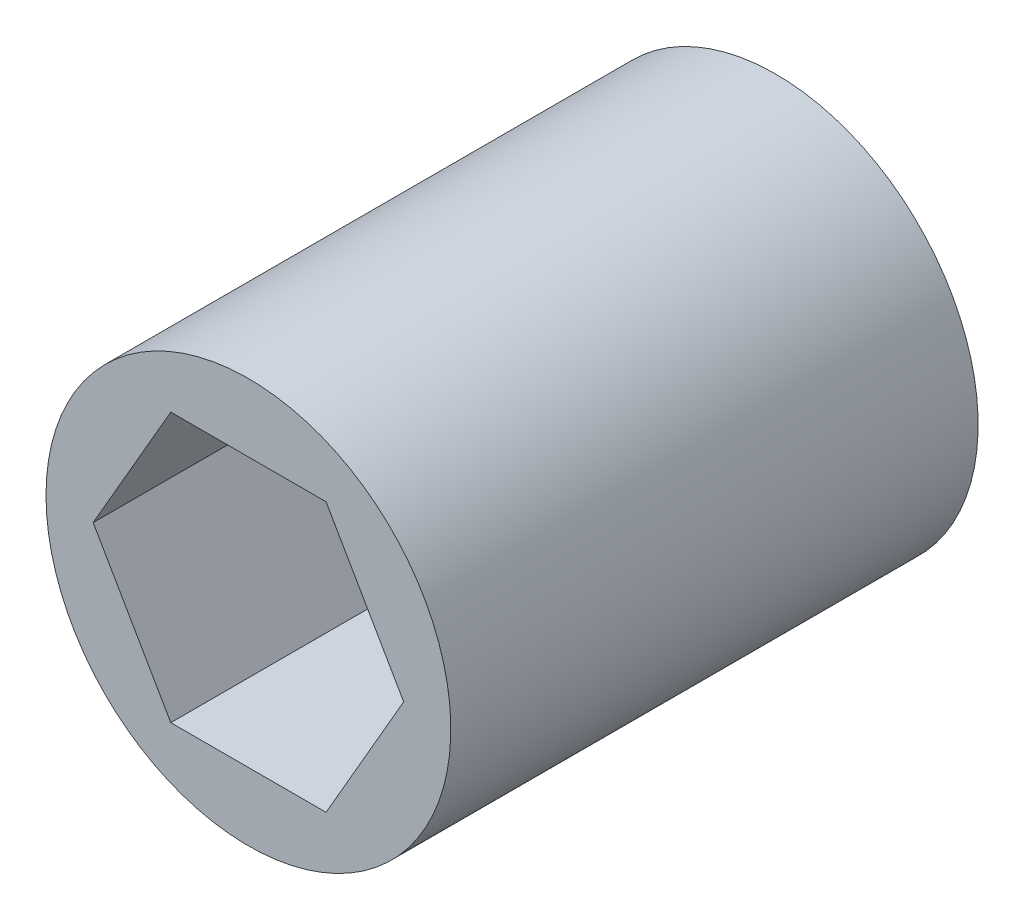
ISO-10303-21;
HEADER;
FILE_DESCRIPTION(('STEP AP214'),'2;1');
FILE_NAME('part.step','',(''),(''),'','','');
FILE_SCHEMA(('AUTOMOTIVE_DESIGN { 1 0 10303 214 1 1 1 1 }'));
ENDSEC;
DATA;
#1=APPLICATION_CONTEXT('core data for automotive mechanical design processes');
#2=APPLICATION_PROTOCOL_DEFINITION('international standard','automotive_design',2000,#1);
#3=PRODUCT_CONTEXT('',#1,'mechanical');
#4=PRODUCT('Part','Part','',(#3));
#5=PRODUCT_RELATED_PRODUCT_CATEGORY('part','',(#4));
#6=PRODUCT_DEFINITION_FORMATION('','',#4);
#7=PRODUCT_DEFINITION_CONTEXT('part definition',#1,'design');
#8=PRODUCT_DEFINITION('design','',#6,#7);
#9=PRODUCT_DEFINITION_SHAPE('','',#8);
#10=(LENGTH_UNIT() NAMED_UNIT(*) SI_UNIT(.MILLI.,.METRE.));
#11=(NAMED_UNIT(*) PLANE_ANGLE_UNIT() SI_UNIT($,.RADIAN.));
#12=(NAMED_UNIT(*) SI_UNIT($,.STERADIAN.) SOLID_ANGLE_UNIT());
#13=UNCERTAINTY_MEASURE_WITH_UNIT(LENGTH_MEASURE(1.E-05),#10,'distance_accuracy_value','');
#14=(GEOMETRIC_REPRESENTATION_CONTEXT(3) GLOBAL_UNCERTAINTY_ASSIGNED_CONTEXT((#13)) GLOBAL_UNIT_ASSIGNED_CONTEXT((#10,
#11,#12)) REPRESENTATION_CONTEXT('',''));
#15=CARTESIAN_POINT('',(0.,0.,0.));
#16=DIRECTION('',(0.,0.,1.));
#17=DIRECTION('',(1.,0.,0.));
#18=AXIS2_PLACEMENT_3D('',#15,#16,#17);
#19=CARTESIAN_POINT('',(-7.47899538708241,0.,12.7));
#20=DIRECTION('',(0.866025403784439,0.5,0.));
#21=DIRECTION('',(-0.5,0.866025403784439,0.));
#22=AXIS2_PLACEMENT_3D('',#19,#20,#21);
#23=PLANE('',#22);
#24=DIRECTION('',(-0.5,0.866025403784438,0.));
#25=VECTOR('',#24,1.);
#26=CARTESIAN_POINT('',(-3.73949769354121,-6.477,12.7));
#27=LINE('',#26,#25);
#28=CARTESIAN_POINT('',(-3.73949769354121,-6.477,12.7));
#29=VERTEX_POINT('',#28);
#30=CARTESIAN_POINT('',(-7.47899538708241,0.,12.7));
#31=VERTEX_POINT('',#30);
#32=EDGE_CURVE('E83',#29,#31,#27,.T.);
#33=ORIENTED_EDGE('',*,*,#32,.F.);
#34=DIRECTION('',(0.,0.,1.));
#35=VECTOR('',#34,1.);
#36=CARTESIAN_POINT('',(-3.73949769354121,-6.477,12.7));
#37=LINE('',#36,#35);
#38=CARTESIAN_POINT('',(-3.73949769354121,-6.477,-12.7));
#39=VERTEX_POINT('',#38);
#40=EDGE_CURVE('E75',#39,#29,#37,.T.);
#41=ORIENTED_EDGE('',*,*,#40,.F.);
#42=DIRECTION('',(-0.5,0.866025403784439,0.));
#43=VECTOR('',#42,1.);
#44=CARTESIAN_POINT('',(-3.73949769354121,-6.477,-12.7));
#45=LINE('',#44,#43);
#46=CARTESIAN_POINT('',(-7.47899538708241,0.,-12.7));
#47=VERTEX_POINT('',#46);
#48=EDGE_CURVE('E115',#39,#47,#45,.T.);
#49=ORIENTED_EDGE('',*,*,#48,.T.);
#50=DIRECTION('',(0.,0.,1.));
#51=VECTOR('',#50,1.);
#52=CARTESIAN_POINT('',(-7.47899538708241,0.,12.7));
#53=LINE('',#52,#51);
#54=EDGE_CURVE('E100',#31,#47,#53,.F.);
#55=ORIENTED_EDGE('',*,*,#54,.F.);
#56=EDGE_LOOP('',(#33,#41,#49,#55));
#57=FACE_BOUND('',#56,.T.);
#58=ADVANCED_FACE('F16',(#57),#23,.T.);
#59=CARTESIAN_POINT('',(-3.73949769354121,6.477,12.7));
#60=DIRECTION('',(0.866025403784439,-0.5,0.));
#61=DIRECTION('',(0.5,0.866025403784439,0.));
#62=AXIS2_PLACEMENT_3D('',#59,#60,#61);
#63=PLANE('',#62);
#64=DIRECTION('',(0.5,0.866025403784439,0.));
#65=VECTOR('',#64,1.);
#66=CARTESIAN_POINT('',(-7.47899538708242,0.,12.7));
#67=LINE('',#66,#65);
#68=CARTESIAN_POINT('',(-3.73949769354121,6.477,12.7));
#69=VERTEX_POINT('',#68);
#70=EDGE_CURVE('E108',#31,#69,#67,.T.);
#71=ORIENTED_EDGE('',*,*,#70,.F.);
#72=ORIENTED_EDGE('',*,*,#54,.T.);
#73=DIRECTION('',(0.5,0.866025403784439,0.));
#74=VECTOR('',#73,1.);
#75=CARTESIAN_POINT('',(-7.47899538708241,0.,-12.7));
#76=LINE('',#75,#74);
#77=CARTESIAN_POINT('',(-3.73949769354121,6.477,-12.7));
#78=VERTEX_POINT('',#77);
#79=EDGE_CURVE('E106',#47,#78,#76,.T.);
#80=ORIENTED_EDGE('',*,*,#79,.T.);
#81=DIRECTION('',(0.,0.,1.));
#82=VECTOR('',#81,1.);
#83=CARTESIAN_POINT('',(-3.73949769354121,6.477,12.7));
#84=LINE('',#83,#82);
#85=EDGE_CURVE('E97',#69,#78,#84,.F.);
#86=ORIENTED_EDGE('',*,*,#85,.F.);
#87=EDGE_LOOP('',(#71,#72,#80,#86));
#88=FACE_BOUND('',#87,.T.);
#89=ADVANCED_FACE('F105',(#88),#63,.T.);
#90=CARTESIAN_POINT('',(3.7394976935412,6.477,12.7));
#91=DIRECTION('',(0.,-1.,0.));
#92=DIRECTION('',(1.,0.,0.));
#93=AXIS2_PLACEMENT_3D('',#90,#91,#92);
#94=PLANE('',#93);
#95=DIRECTION('',(1.,0.,0.));
#96=VECTOR('',#95,1.);
#97=CARTESIAN_POINT('',(0.,6.477,12.7));
#98=LINE('',#97,#96);
#99=CARTESIAN_POINT('',(3.7394976935412,6.477,12.7));
#100=VERTEX_POINT('',#99);
#101=EDGE_CURVE('E125',#69,#100,#98,.T.);
#102=ORIENTED_EDGE('',*,*,#101,.F.);
#103=ORIENTED_EDGE('',*,*,#85,.T.);
#104=DIRECTION('',(1.,0.,0.));
#105=VECTOR('',#104,1.);
#106=CARTESIAN_POINT('',(0.,6.477,-12.7));
#107=LINE('',#106,#105);
#108=CARTESIAN_POINT('',(3.7394976935412,6.477,-12.7));
#109=VERTEX_POINT('',#108);
#110=EDGE_CURVE('E117',#78,#109,#107,.T.);
#111=ORIENTED_EDGE('',*,*,#110,.T.);
#112=DIRECTION('',(0.,0.,1.));
#113=VECTOR('',#112,1.);
#114=CARTESIAN_POINT('',(3.7394976935412,6.47700000000001,12.7));
#115=LINE('',#114,#113);
#116=EDGE_CURVE('E94',#100,#109,#115,.F.);
#117=ORIENTED_EDGE('',*,*,#116,.F.);
#118=EDGE_LOOP('',(#102,#103,#111,#117));
#119=FACE_BOUND('',#118,.T.);
#120=ADVANCED_FACE('F134',(#119),#94,.T.);
#121=CARTESIAN_POINT('',(7.47899538708241,0.,12.7));
#122=DIRECTION('',(-0.866025403784439,-0.5,0.));
#123=DIRECTION('',(0.5,-0.866025403784439,0.));
#124=AXIS2_PLACEMENT_3D('',#121,#122,#123);
#125=PLANE('',#124);
#126=DIRECTION('',(0.5,-0.866025403784438,0.));
#127=VECTOR('',#126,1.);
#128=CARTESIAN_POINT('',(3.7394976935412,6.477,12.7));
#129=LINE('',#128,#127);
#130=CARTESIAN_POINT('',(7.47899538708242,0.,12.7));
#131=VERTEX_POINT('',#130);
#132=EDGE_CURVE('E88',#100,#131,#129,.T.);
#133=ORIENTED_EDGE('',*,*,#132,.F.);
#134=ORIENTED_EDGE('',*,*,#116,.T.);
#135=DIRECTION('',(0.5,-0.866025403784438,0.));
#136=VECTOR('',#135,1.);
#137=CARTESIAN_POINT('',(3.7394976935412,6.477,-12.7));
#138=LINE('',#137,#136);
#139=CARTESIAN_POINT('',(7.47899538708241,0.,-12.7));
#140=VERTEX_POINT('',#139);
#141=EDGE_CURVE('E119',#109,#140,#138,.T.);
#142=ORIENTED_EDGE('',*,*,#141,.T.);
#143=DIRECTION('',(0.,0.,1.));
#144=VECTOR('',#143,1.);
#145=CARTESIAN_POINT('',(7.47899538708242,0.,12.7));
#146=LINE('',#145,#144);
#147=EDGE_CURVE('E64',#131,#140,#146,.F.);
#148=ORIENTED_EDGE('',*,*,#147,.F.);
#149=EDGE_LOOP('',(#133,#134,#142,#148));
#150=FACE_BOUND('',#149,.T.);
#151=ADVANCED_FACE('F131',(#150),#125,.T.);
#152=CARTESIAN_POINT('',(3.73949769354121,-6.477,12.7));
#153=DIRECTION('',(-0.866025403784439,0.5,0.));
#154=DIRECTION('',(-0.5,-0.866025403784439,0.));
#155=AXIS2_PLACEMENT_3D('',#152,#153,#154);
#156=PLANE('',#155);
#157=DIRECTION('',(-0.5,-0.866025403784439,0.));
#158=VECTOR('',#157,1.);
#159=CARTESIAN_POINT('',(7.47899538708241,0.,12.7));
#160=LINE('',#159,#158);
#161=CARTESIAN_POINT('',(3.73949769354121,-6.477,12.7));
#162=VERTEX_POINT('',#161);
#163=EDGE_CURVE('E70',#131,#162,#160,.T.);
#164=ORIENTED_EDGE('',*,*,#163,.F.);
#165=ORIENTED_EDGE('',*,*,#147,.T.);
#166=DIRECTION('',(-0.5,-0.866025403784439,0.));
#167=VECTOR('',#166,1.);
#168=CARTESIAN_POINT('',(7.47899538708241,0.,-12.7));
#169=LINE('',#168,#167);
#170=CARTESIAN_POINT('',(3.73949769354121,-6.477,-12.7));
#171=VERTEX_POINT('',#170);
#172=EDGE_CURVE('E32',#140,#171,#169,.T.);
#173=ORIENTED_EDGE('',*,*,#172,.T.);
#174=DIRECTION('',(0.,0.,1.));
#175=VECTOR('',#174,1.);
#176=CARTESIAN_POINT('',(3.73949769354121,-6.477,12.7));
#177=LINE('',#176,#175);
#178=EDGE_CURVE('E66',#162,#171,#177,.F.);
#179=ORIENTED_EDGE('',*,*,#178,.F.);
#180=EDGE_LOOP('',(#164,#165,#173,#179));
#181=FACE_BOUND('',#180,.T.);
#182=ADVANCED_FACE('F68',(#181),#156,.T.);
#183=CARTESIAN_POINT('',(-3.73949769354121,-6.477,12.7));
#184=DIRECTION('',(0.,1.,0.));
#185=DIRECTION('',(0.,0.,1.));
#186=AXIS2_PLACEMENT_3D('',#183,#184,#185);
#187=PLANE('',#186);
#188=DIRECTION('',(1.,0.,0.));
#189=VECTOR('',#188,1.);
#190=CARTESIAN_POINT('',(0.,-6.477,12.7));
#191=LINE('',#190,#189);
#192=EDGE_CURVE('E78',#162,#29,#191,.F.);
#193=ORIENTED_EDGE('',*,*,#192,.F.);
#194=ORIENTED_EDGE('',*,*,#178,.T.);
#195=DIRECTION('',(1.,0.,0.));
#196=VECTOR('',#195,1.);
#197=CARTESIAN_POINT('',(0.,-6.477,-12.7));
#198=LINE('',#197,#196);
#199=EDGE_CURVE('E127',#171,#39,#198,.F.);
#200=ORIENTED_EDGE('',*,*,#199,.T.);
#201=ORIENTED_EDGE('',*,*,#40,.T.);
#202=EDGE_LOOP('',(#193,#194,#200,#201));
#203=FACE_BOUND('',#202,.T.);
#204=ADVANCED_FACE('F79',(#203),#187,.T.);
#205=CARTESIAN_POINT('',(0.,0.,12.7));
#206=DIRECTION('',(0.,0.,1.));
#207=DIRECTION('',(1.,0.,0.));
#208=AXIS2_PLACEMENT_3D('',#205,#206,#207);
#209=PLANE('',#208);
#210=ORIENTED_EDGE('',*,*,#101,.T.);
#211=ORIENTED_EDGE('',*,*,#132,.T.);
#212=ORIENTED_EDGE('',*,*,#163,.T.);
#213=ORIENTED_EDGE('',*,*,#192,.T.);
#214=ORIENTED_EDGE('',*,*,#32,.T.);
#215=ORIENTED_EDGE('',*,*,#70,.T.);
#216=EDGE_LOOP('',(#210,#211,#212,#213,#214,#215));
#217=FACE_BOUND('',#216,.T.);
#218=CARTESIAN_POINT('',(0.,0.,12.7));
#219=DIRECTION('',(0.,0.,-1.));
#220=DIRECTION('',(-1.,0.,0.));
#221=AXIS2_PLACEMENT_3D('',#218,#219,#220);
#222=CIRCLE('',#221,9.75);
#223=CARTESIAN_POINT('',(-9.75,0.,12.7));
#224=VERTEX_POINT('',#223);
#225=EDGE_CURVE('E19',#224,#224,#222,.T.);
#226=ORIENTED_EDGE('',*,*,#225,.F.);
#227=EDGE_LOOP('',(#226));
#228=FACE_BOUND('',#227,.T.);
#229=ADVANCED_FACE('F86',(#217,#228),#209,.T.);
#230=CARTESIAN_POINT('',(0.,0.,-12.7));
#231=DIRECTION('',(0.,0.,1.));
#232=DIRECTION('',(1.,0.,0.));
#233=AXIS2_PLACEMENT_3D('',#230,#231,#232);
#234=PLANE('',#233);
#235=ORIENTED_EDGE('',*,*,#172,.F.);
#236=ORIENTED_EDGE('',*,*,#141,.F.);
#237=ORIENTED_EDGE('',*,*,#110,.F.);
#238=ORIENTED_EDGE('',*,*,#79,.F.);
#239=ORIENTED_EDGE('',*,*,#48,.F.);
#240=ORIENTED_EDGE('',*,*,#199,.F.);
#241=EDGE_LOOP('',(#235,#236,#237,#238,#239,#240));
#242=FACE_BOUND('',#241,.T.);
#243=CARTESIAN_POINT('',(0.,0.,-12.7));
#244=DIRECTION('',(0.,0.,-1.));
#245=DIRECTION('',(-1.,0.,0.));
#246=AXIS2_PLACEMENT_3D('',#243,#244,#245);
#247=CIRCLE('',#246,9.75);
#248=CARTESIAN_POINT('',(-9.75,0.,-12.7));
#249=VERTEX_POINT('',#248);
#250=EDGE_CURVE('E11',#249,#249,#247,.F.);
#251=ORIENTED_EDGE('',*,*,#250,.F.);
#252=EDGE_LOOP('',(#251));
#253=FACE_BOUND('',#252,.T.);
#254=ADVANCED_FACE('F113',(#242,#253),#234,.F.);
#255=CARTESIAN_POINT('',(0.,0.,12.7));
#256=DIRECTION('',(0.,0.,-1.));
#257=DIRECTION('',(-1.,0.,0.));
#258=AXIS2_PLACEMENT_3D('',#255,#256,#257);
#259=CYLINDRICAL_SURFACE('',#258,9.75);
#260=ORIENTED_EDGE('',*,*,#250,.T.);
#261=EDGE_LOOP('',(#260));
#262=FACE_BOUND('',#261,.T.);
#263=ORIENTED_EDGE('',*,*,#225,.T.);
#264=EDGE_LOOP('',(#263));
#265=FACE_BOUND('',#264,.T.);
#266=ADVANCED_FACE('F143',(#262,#265),#259,.T.);
#267=CLOSED_SHELL('',(#58,#89,#120,#151,#182,#204,#229,#254,#266));
#268=MANIFOLD_SOLID_BREP('B1',#267);
#269=ADVANCED_BREP_SHAPE_REPRESENTATION('',(#18,#268),#14);
#270=SHAPE_DEFINITION_REPRESENTATION(#9,#269);
ENDSEC;
END-ISO-10303-21;
